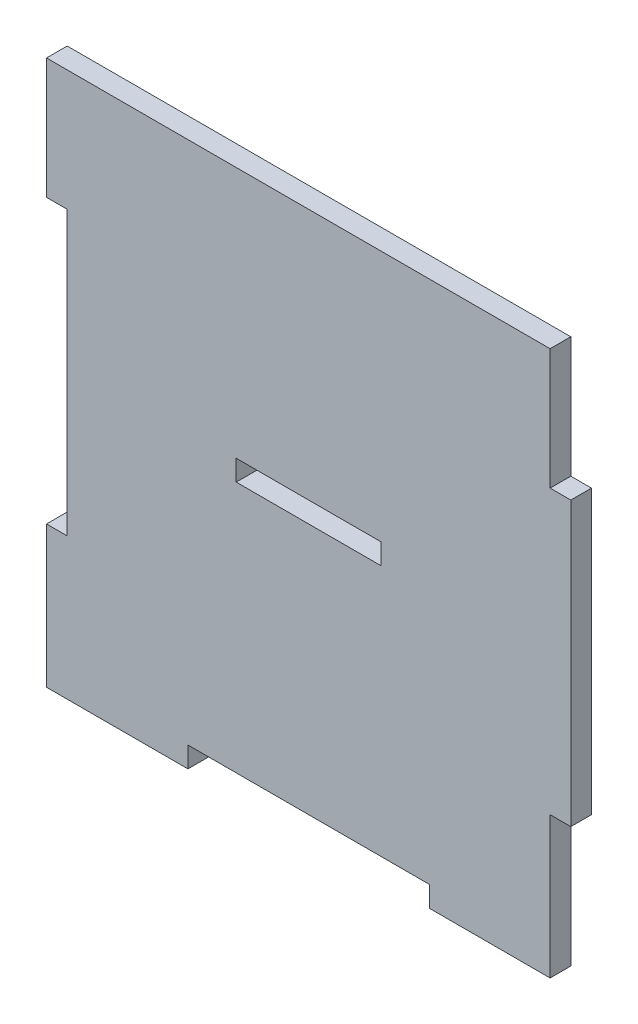
ISO-10303-21;
HEADER;
FILE_DESCRIPTION(('STEP AP214'),'2;1');
FILE_NAME('part.step','',(''),(''),'','','');
FILE_SCHEMA(('AUTOMOTIVE_DESIGN { 1 0 10303 214 1 1 1 1 }'));
ENDSEC;
DATA;
#1=APPLICATION_CONTEXT('core data for automotive mechanical design processes');
#2=APPLICATION_PROTOCOL_DEFINITION('international standard','automotive_design',2000,#1);
#3=PRODUCT_CONTEXT('',#1,'mechanical');
#4=PRODUCT('Part','Part','',(#3));
#5=PRODUCT_RELATED_PRODUCT_CATEGORY('part','',(#4));
#6=PRODUCT_DEFINITION_FORMATION('','',#4);
#7=PRODUCT_DEFINITION_CONTEXT('part definition',#1,'design');
#8=PRODUCT_DEFINITION('design','',#6,#7);
#9=PRODUCT_DEFINITION_SHAPE('','',#8);
#10=(LENGTH_UNIT() NAMED_UNIT(*) SI_UNIT(.MILLI.,.METRE.));
#11=(NAMED_UNIT(*) PLANE_ANGLE_UNIT() SI_UNIT($,.RADIAN.));
#12=(NAMED_UNIT(*) SI_UNIT($,.STERADIAN.) SOLID_ANGLE_UNIT());
#13=UNCERTAINTY_MEASURE_WITH_UNIT(LENGTH_MEASURE(1.E-05),#10,'distance_accuracy_value','');
#14=(GEOMETRIC_REPRESENTATION_CONTEXT(3) GLOBAL_UNCERTAINTY_ASSIGNED_CONTEXT((#13)) GLOBAL_UNIT_ASSIGNED_CONTEXT((#10,
#11,#12)) REPRESENTATION_CONTEXT('',''));
#15=CARTESIAN_POINT('',(0.,0.,0.));
#16=DIRECTION('',(0.,0.,1.));
#17=DIRECTION('',(1.,0.,0.));
#18=AXIS2_PLACEMENT_3D('',#15,#16,#17);
#19=CARTESIAN_POINT('',(35.,-20.5,3.));
#20=DIRECTION('',(0.,1.,0.));
#21=DIRECTION('',(-1.,0.,0.));
#22=AXIS2_PLACEMENT_3D('',#19,#20,#21);
#23=PLANE('',#22);
#24=DIRECTION('',(1.,0.,0.));
#25=VECTOR('',#24,1.);
#26=CARTESIAN_POINT('',(35.,-20.5,0.));
#27=LINE('',#26,#25);
#28=CARTESIAN_POINT('',(35.,-20.5,0.));
#29=VERTEX_POINT('',#28);
#30=CARTESIAN_POINT('',(38.,-20.5,0.));
#31=VERTEX_POINT('',#30);
#32=EDGE_CURVE('E218',#29,#31,#27,.T.);
#33=ORIENTED_EDGE('',*,*,#32,.T.);
#34=DIRECTION('',(0.,0.,-1.));
#35=VECTOR('',#34,1.);
#36=CARTESIAN_POINT('',(38.,-20.5,3.));
#37=LINE('',#36,#35);
#38=CARTESIAN_POINT('',(38.,-20.5,3.));
#39=VERTEX_POINT('',#38);
#40=EDGE_CURVE('E46',#39,#31,#37,.T.);
#41=ORIENTED_EDGE('',*,*,#40,.F.);
#42=DIRECTION('',(1.,0.,0.));
#43=VECTOR('',#42,1.);
#44=CARTESIAN_POINT('',(35.,-20.5,3.));
#45=LINE('',#44,#43);
#46=CARTESIAN_POINT('',(35.,-20.5,3.));
#47=VERTEX_POINT('',#46);
#48=EDGE_CURVE('E228',#47,#39,#45,.T.);
#49=ORIENTED_EDGE('',*,*,#48,.F.);
#50=DIRECTION('',(0.,0.,-1.));
#51=VECTOR('',#50,1.);
#52=CARTESIAN_POINT('',(35.,-20.5,3.));
#53=LINE('',#52,#51);
#54=EDGE_CURVE('E11',#47,#29,#53,.T.);
#55=ORIENTED_EDGE('',*,*,#54,.T.);
#56=EDGE_LOOP('',(#33,#41,#49,#55));
#57=FACE_BOUND('',#56,.T.);
#58=ADVANCED_FACE('F38',(#57),#23,.F.);
#59=CARTESIAN_POINT('',(38.,20.5,3.));
#60=DIRECTION('',(-1.,0.,0.));
#61=DIRECTION('',(0.,0.,1.));
#62=AXIS2_PLACEMENT_3D('',#59,#60,#61);
#63=PLANE('',#62);
#64=DIRECTION('',(0.,1.,0.));
#65=VECTOR('',#64,1.);
#66=CARTESIAN_POINT('',(38.,20.5,0.));
#67=LINE('',#66,#65);
#68=CARTESIAN_POINT('',(38.,20.5,0.));
#69=VERTEX_POINT('',#68);
#70=EDGE_CURVE('E278',#31,#69,#67,.T.);
#71=ORIENTED_EDGE('',*,*,#70,.T.);
#72=DIRECTION('',(0.,0.,-1.));
#73=VECTOR('',#72,1.);
#74=CARTESIAN_POINT('',(38.,20.5,3.));
#75=LINE('',#74,#73);
#76=CARTESIAN_POINT('',(38.,20.5,3.));
#77=VERTEX_POINT('',#76);
#78=EDGE_CURVE('E376',#77,#69,#75,.T.);
#79=ORIENTED_EDGE('',*,*,#78,.F.);
#80=DIRECTION('',(0.,1.,0.));
#81=VECTOR('',#80,1.);
#82=CARTESIAN_POINT('',(38.,20.5,3.));
#83=LINE('',#82,#81);
#84=EDGE_CURVE('E232',#39,#77,#83,.T.);
#85=ORIENTED_EDGE('',*,*,#84,.F.);
#86=ORIENTED_EDGE('',*,*,#40,.T.);
#87=EDGE_LOOP('',(#71,#79,#85,#86));
#88=FACE_BOUND('',#87,.T.);
#89=ADVANCED_FACE('F385',(#88),#63,.F.);
#90=CARTESIAN_POINT('',(35.,20.5,3.));
#91=DIRECTION('',(0.,-1.,0.));
#92=DIRECTION('',(1.,0.,0.));
#93=AXIS2_PLACEMENT_3D('',#90,#91,#92);
#94=PLANE('',#93);
#95=DIRECTION('',(-1.,0.,0.));
#96=VECTOR('',#95,1.);
#97=CARTESIAN_POINT('',(35.,20.5,0.));
#98=LINE('',#97,#96);
#99=CARTESIAN_POINT('',(35.,20.5,0.));
#100=VERTEX_POINT('',#99);
#101=EDGE_CURVE('E281',#69,#100,#98,.T.);
#102=ORIENTED_EDGE('',*,*,#101,.T.);
#103=DIRECTION('',(0.,0.,-1.));
#104=VECTOR('',#103,1.);
#105=CARTESIAN_POINT('',(35.,20.5,3.));
#106=LINE('',#105,#104);
#107=CARTESIAN_POINT('',(35.,20.5,3.));
#108=VERTEX_POINT('',#107);
#109=EDGE_CURVE('E372',#108,#100,#106,.T.);
#110=ORIENTED_EDGE('',*,*,#109,.F.);
#111=DIRECTION('',(-1.,0.,0.));
#112=VECTOR('',#111,1.);
#113=CARTESIAN_POINT('',(35.,20.5,3.));
#114=LINE('',#113,#112);
#115=EDGE_CURVE('E235',#77,#108,#114,.T.);
#116=ORIENTED_EDGE('',*,*,#115,.F.);
#117=ORIENTED_EDGE('',*,*,#78,.T.);
#118=EDGE_LOOP('',(#102,#110,#116,#117));
#119=FACE_BOUND('',#118,.T.);
#120=ADVANCED_FACE('F394',(#119),#94,.F.);
#121=CARTESIAN_POINT('',(35.,38.,3.));
#122=DIRECTION('',(-1.,0.,0.));
#123=DIRECTION('',(0.,-1.,0.));
#124=AXIS2_PLACEMENT_3D('',#121,#122,#123);
#125=PLANE('',#124);
#126=DIRECTION('',(0.,1.,0.));
#127=VECTOR('',#126,1.);
#128=CARTESIAN_POINT('',(35.,38.,0.));
#129=LINE('',#128,#127);
#130=CARTESIAN_POINT('',(35.,38.,0.));
#131=VERTEX_POINT('',#130);
#132=EDGE_CURVE('E284',#100,#131,#129,.T.);
#133=ORIENTED_EDGE('',*,*,#132,.T.);
#134=DIRECTION('',(0.,0.,-1.));
#135=VECTOR('',#134,1.);
#136=CARTESIAN_POINT('',(35.,38.,3.));
#137=LINE('',#136,#135);
#138=CARTESIAN_POINT('',(35.,38.,3.));
#139=VERTEX_POINT('',#138);
#140=EDGE_CURVE('E368',#139,#131,#137,.T.);
#141=ORIENTED_EDGE('',*,*,#140,.F.);
#142=DIRECTION('',(0.,1.,0.));
#143=VECTOR('',#142,1.);
#144=CARTESIAN_POINT('',(35.,38.,3.));
#145=LINE('',#144,#143);
#146=EDGE_CURVE('E238',#108,#139,#145,.T.);
#147=ORIENTED_EDGE('',*,*,#146,.F.);
#148=ORIENTED_EDGE('',*,*,#109,.T.);
#149=EDGE_LOOP('',(#133,#141,#147,#148));
#150=FACE_BOUND('',#149,.T.);
#151=ADVANCED_FACE('F398',(#150),#125,.F.);
#152=CARTESIAN_POINT('',(-38.,38.,3.));
#153=DIRECTION('',(0.,-1.,0.));
#154=DIRECTION('',(0.,0.,-1.));
#155=AXIS2_PLACEMENT_3D('',#152,#153,#154);
#156=PLANE('',#155);
#157=DIRECTION('',(-1.,0.,0.));
#158=VECTOR('',#157,1.);
#159=CARTESIAN_POINT('',(-38.,38.,0.));
#160=LINE('',#159,#158);
#161=CARTESIAN_POINT('',(-38.,38.,0.));
#162=VERTEX_POINT('',#161);
#163=EDGE_CURVE('E288',#131,#162,#160,.T.);
#164=ORIENTED_EDGE('',*,*,#163,.T.);
#165=DIRECTION('',(0.,0.,-1.));
#166=VECTOR('',#165,1.);
#167=CARTESIAN_POINT('',(-38.,38.,3.));
#168=LINE('',#167,#166);
#169=CARTESIAN_POINT('',(-38.,38.,3.));
#170=VERTEX_POINT('',#169);
#171=EDGE_CURVE('E364',#170,#162,#168,.T.);
#172=ORIENTED_EDGE('',*,*,#171,.F.);
#173=DIRECTION('',(-1.,0.,0.));
#174=VECTOR('',#173,1.);
#175=CARTESIAN_POINT('',(17.5,38.,3.));
#176=LINE('',#175,#174);
#177=EDGE_CURVE('E241',#139,#170,#176,.T.);
#178=ORIENTED_EDGE('',*,*,#177,.F.);
#179=ORIENTED_EDGE('',*,*,#140,.T.);
#180=EDGE_LOOP('',(#164,#172,#178,#179));
#181=FACE_BOUND('',#180,.T.);
#182=ADVANCED_FACE('F456',(#181),#156,.F.);
#183=CARTESIAN_POINT('',(-38.,20.5,3.));
#184=DIRECTION('',(1.,0.,0.));
#185=DIRECTION('',(0.,0.,-1.));
#186=AXIS2_PLACEMENT_3D('',#183,#184,#185);
#187=PLANE('',#186);
#188=DIRECTION('',(0.,-1.,0.));
#189=VECTOR('',#188,1.);
#190=CARTESIAN_POINT('',(-38.,20.5,0.));
#191=LINE('',#190,#189);
#192=CARTESIAN_POINT('',(-38.,20.5,0.));
#193=VERTEX_POINT('',#192);
#194=EDGE_CURVE('E291',#162,#193,#191,.T.);
#195=ORIENTED_EDGE('',*,*,#194,.T.);
#196=DIRECTION('',(0.,0.,-1.));
#197=VECTOR('',#196,1.);
#198=CARTESIAN_POINT('',(-38.,20.5,3.));
#199=LINE('',#198,#197);
#200=CARTESIAN_POINT('',(-38.,20.5,3.));
#201=VERTEX_POINT('',#200);
#202=EDGE_CURVE('E360',#201,#193,#199,.T.);
#203=ORIENTED_EDGE('',*,*,#202,.F.);
#204=DIRECTION('',(0.,-1.,0.));
#205=VECTOR('',#204,1.);
#206=CARTESIAN_POINT('',(-38.,20.5,3.));
#207=LINE('',#206,#205);
#208=EDGE_CURVE('E244',#170,#201,#207,.T.);
#209=ORIENTED_EDGE('',*,*,#208,.F.);
#210=ORIENTED_EDGE('',*,*,#171,.T.);
#211=EDGE_LOOP('',(#195,#203,#209,#210));
#212=FACE_BOUND('',#211,.T.);
#213=ADVANCED_FACE('F454',(#212),#187,.F.);
#214=CARTESIAN_POINT('',(-35.,20.5,3.));
#215=DIRECTION('',(0.,1.,0.));
#216=DIRECTION('',(0.,0.,1.));
#217=AXIS2_PLACEMENT_3D('',#214,#215,#216);
#218=PLANE('',#217);
#219=DIRECTION('',(1.,0.,0.));
#220=VECTOR('',#219,1.);
#221=CARTESIAN_POINT('',(-35.,20.5,0.));
#222=LINE('',#221,#220);
#223=CARTESIAN_POINT('',(-35.,20.5,0.));
#224=VERTEX_POINT('',#223);
#225=EDGE_CURVE('E294',#193,#224,#222,.T.);
#226=ORIENTED_EDGE('',*,*,#225,.T.);
#227=DIRECTION('',(0.,0.,-1.));
#228=VECTOR('',#227,1.);
#229=CARTESIAN_POINT('',(-35.,20.5,3.));
#230=LINE('',#229,#228);
#231=CARTESIAN_POINT('',(-35.,20.5,3.));
#232=VERTEX_POINT('',#231);
#233=EDGE_CURVE('E356',#232,#224,#230,.T.);
#234=ORIENTED_EDGE('',*,*,#233,.F.);
#235=DIRECTION('',(1.,0.,0.));
#236=VECTOR('',#235,1.);
#237=CARTESIAN_POINT('',(-35.,20.5,3.));
#238=LINE('',#237,#236);
#239=EDGE_CURVE('E247',#201,#232,#238,.T.);
#240=ORIENTED_EDGE('',*,*,#239,.F.);
#241=ORIENTED_EDGE('',*,*,#202,.T.);
#242=EDGE_LOOP('',(#226,#234,#240,#241));
#243=FACE_BOUND('',#242,.T.);
#244=ADVANCED_FACE('F449',(#243),#218,.F.);
#245=CARTESIAN_POINT('',(-35.,20.5,3.));
#246=DIRECTION('',(1.,0.,0.));
#247=DIRECTION('',(0.,0.,-1.));
#248=AXIS2_PLACEMENT_3D('',#245,#246,#247);
#249=PLANE('',#248);
#250=DIRECTION('',(0.,-1.,0.));
#251=VECTOR('',#250,1.);
#252=CARTESIAN_POINT('',(-35.,20.5,0.));
#253=LINE('',#252,#251);
#254=CARTESIAN_POINT('',(-35.,-20.5,0.));
#255=VERTEX_POINT('',#254);
#256=EDGE_CURVE('E297',#224,#255,#253,.T.);
#257=ORIENTED_EDGE('',*,*,#256,.T.);
#258=DIRECTION('',(0.,0.,-1.));
#259=VECTOR('',#258,1.);
#260=CARTESIAN_POINT('',(-35.,-20.5,3.));
#261=LINE('',#260,#259);
#262=CARTESIAN_POINT('',(-35.,-20.5,3.));
#263=VERTEX_POINT('',#262);
#264=EDGE_CURVE('E352',#263,#255,#261,.T.);
#265=ORIENTED_EDGE('',*,*,#264,.F.);
#266=DIRECTION('',(0.,-1.,0.));
#267=VECTOR('',#266,1.);
#268=CARTESIAN_POINT('',(-35.,20.5,3.));
#269=LINE('',#268,#267);
#270=EDGE_CURVE('E250',#232,#263,#269,.T.);
#271=ORIENTED_EDGE('',*,*,#270,.F.);
#272=ORIENTED_EDGE('',*,*,#233,.T.);
#273=EDGE_LOOP('',(#257,#265,#271,#272));
#274=FACE_BOUND('',#273,.T.);
#275=ADVANCED_FACE('F444',(#274),#249,.F.);
#276=CARTESIAN_POINT('',(-35.,-20.5,3.));
#277=DIRECTION('',(0.,-1.,0.));
#278=DIRECTION('',(0.,0.,-1.));
#279=AXIS2_PLACEMENT_3D('',#276,#277,#278);
#280=PLANE('',#279);
#281=DIRECTION('',(-1.,0.,0.));
#282=VECTOR('',#281,1.);
#283=CARTESIAN_POINT('',(-35.,-20.5,0.));
#284=LINE('',#283,#282);
#285=CARTESIAN_POINT('',(-38.,-20.5,0.));
#286=VERTEX_POINT('',#285);
#287=EDGE_CURVE('E300',#255,#286,#284,.T.);
#288=ORIENTED_EDGE('',*,*,#287,.T.);
#289=DIRECTION('',(0.,0.,-1.));
#290=VECTOR('',#289,1.);
#291=CARTESIAN_POINT('',(-38.,-20.5,3.));
#292=LINE('',#291,#290);
#293=CARTESIAN_POINT('',(-38.,-20.5,3.));
#294=VERTEX_POINT('',#293);
#295=EDGE_CURVE('E348',#294,#286,#292,.T.);
#296=ORIENTED_EDGE('',*,*,#295,.F.);
#297=DIRECTION('',(-1.,0.,0.));
#298=VECTOR('',#297,1.);
#299=CARTESIAN_POINT('',(-35.,-20.5,3.));
#300=LINE('',#299,#298);
#301=EDGE_CURVE('E253',#263,#294,#300,.T.);
#302=ORIENTED_EDGE('',*,*,#301,.F.);
#303=ORIENTED_EDGE('',*,*,#264,.T.);
#304=EDGE_LOOP('',(#288,#296,#302,#303));
#305=FACE_BOUND('',#304,.T.);
#306=ADVANCED_FACE('F439',(#305),#280,.F.);
#307=CARTESIAN_POINT('',(-38.,-38.,3.));
#308=DIRECTION('',(1.,0.,0.));
#309=DIRECTION('',(0.,0.,-1.));
#310=AXIS2_PLACEMENT_3D('',#307,#308,#309);
#311=PLANE('',#310);
#312=DIRECTION('',(0.,-1.,0.));
#313=VECTOR('',#312,1.);
#314=CARTESIAN_POINT('',(-38.,-38.,0.));
#315=LINE('',#314,#313);
#316=CARTESIAN_POINT('',(-38.,-41.,0.));
#317=VERTEX_POINT('',#316);
#318=EDGE_CURVE('E304',#286,#317,#315,.T.);
#319=ORIENTED_EDGE('',*,*,#318,.T.);
#320=DIRECTION('',(0.,0.,-1.));
#321=VECTOR('',#320,1.);
#322=CARTESIAN_POINT('',(-38.,-41.,3.));
#323=LINE('',#322,#321);
#324=CARTESIAN_POINT('',(-38.,-41.,3.));
#325=VERTEX_POINT('',#324);
#326=EDGE_CURVE('E344',#325,#317,#323,.T.);
#327=ORIENTED_EDGE('',*,*,#326,.F.);
#328=DIRECTION('',(0.,-1.,0.));
#329=VECTOR('',#328,1.);
#330=CARTESIAN_POINT('',(-38.,-20.5,3.));
#331=LINE('',#330,#329);
#332=EDGE_CURVE('E256',#294,#325,#331,.T.);
#333=ORIENTED_EDGE('',*,*,#332,.F.);
#334=ORIENTED_EDGE('',*,*,#295,.T.);
#335=EDGE_LOOP('',(#319,#327,#333,#334));
#336=FACE_BOUND('',#335,.T.);
#337=ADVANCED_FACE('F434',(#336),#311,.F.);
#338=CARTESIAN_POINT('',(-35.,-41.,3.));
#339=DIRECTION('',(0.,1.,0.));
#340=DIRECTION('',(0.,0.,1.));
#341=AXIS2_PLACEMENT_3D('',#338,#339,#340);
#342=PLANE('',#341);
#343=DIRECTION('',(1.,0.,0.));
#344=VECTOR('',#343,1.);
#345=CARTESIAN_POINT('',(-35.,-41.,0.));
#346=LINE('',#345,#344);
#347=CARTESIAN_POINT('',(-17.5,-41.,0.));
#348=VERTEX_POINT('',#347);
#349=EDGE_CURVE('E308',#317,#348,#346,.T.);
#350=ORIENTED_EDGE('',*,*,#349,.T.);
#351=DIRECTION('',(0.,0.,-1.));
#352=VECTOR('',#351,1.);
#353=CARTESIAN_POINT('',(-17.5,-41.,3.));
#354=LINE('',#353,#352);
#355=CARTESIAN_POINT('',(-17.5,-41.,3.));
#356=VERTEX_POINT('',#355);
#357=EDGE_CURVE('E340',#356,#348,#354,.T.);
#358=ORIENTED_EDGE('',*,*,#357,.F.);
#359=DIRECTION('',(1.,0.,0.));
#360=VECTOR('',#359,1.);
#361=CARTESIAN_POINT('',(-38.,-41.,3.));
#362=LINE('',#361,#360);
#363=EDGE_CURVE('E259',#325,#356,#362,.T.);
#364=ORIENTED_EDGE('',*,*,#363,.F.);
#365=ORIENTED_EDGE('',*,*,#326,.T.);
#366=EDGE_LOOP('',(#350,#358,#364,#365));
#367=FACE_BOUND('',#366,.T.);
#368=ADVANCED_FACE('F430',(#367),#342,.F.);
#369=CARTESIAN_POINT('',(-17.5,-38.,3.));
#370=DIRECTION('',(-1.,0.,0.));
#371=DIRECTION('',(0.,0.,1.));
#372=AXIS2_PLACEMENT_3D('',#369,#370,#371);
#373=PLANE('',#372);
#374=DIRECTION('',(0.,1.,0.));
#375=VECTOR('',#374,1.);
#376=CARTESIAN_POINT('',(-17.5,-38.,0.));
#377=LINE('',#376,#375);
#378=CARTESIAN_POINT('',(-17.5,-38.,0.));
#379=VERTEX_POINT('',#378);
#380=EDGE_CURVE('E311',#348,#379,#377,.T.);
#381=ORIENTED_EDGE('',*,*,#380,.T.);
#382=DIRECTION('',(0.,0.,-1.));
#383=VECTOR('',#382,1.);
#384=CARTESIAN_POINT('',(-17.5,-38.,3.));
#385=LINE('',#384,#383);
#386=CARTESIAN_POINT('',(-17.5,-38.,3.));
#387=VERTEX_POINT('',#386);
#388=EDGE_CURVE('E336',#387,#379,#385,.T.);
#389=ORIENTED_EDGE('',*,*,#388,.F.);
#390=DIRECTION('',(0.,1.,0.));
#391=VECTOR('',#390,1.);
#392=CARTESIAN_POINT('',(-17.5,-38.,3.));
#393=LINE('',#392,#391);
#394=EDGE_CURVE('E262',#356,#387,#393,.T.);
#395=ORIENTED_EDGE('',*,*,#394,.F.);
#396=ORIENTED_EDGE('',*,*,#357,.T.);
#397=EDGE_LOOP('',(#381,#389,#395,#396));
#398=FACE_BOUND('',#397,.T.);
#399=ADVANCED_FACE('F425',(#398),#373,.F.);
#400=CARTESIAN_POINT('',(-17.5,-38.,3.));
#401=DIRECTION('',(0.,1.,0.));
#402=DIRECTION('',(-1.,0.,0.));
#403=AXIS2_PLACEMENT_3D('',#400,#401,#402);
#404=PLANE('',#403);
#405=DIRECTION('',(1.,0.,0.));
#406=VECTOR('',#405,1.);
#407=CARTESIAN_POINT('',(-17.5,-38.,0.));
#408=LINE('',#407,#406);
#409=CARTESIAN_POINT('',(17.5,-38.,0.));
#410=VERTEX_POINT('',#409);
#411=EDGE_CURVE('E314',#379,#410,#408,.T.);
#412=ORIENTED_EDGE('',*,*,#411,.T.);
#413=DIRECTION('',(0.,0.,-1.));
#414=VECTOR('',#413,1.);
#415=CARTESIAN_POINT('',(17.5,-38.,3.));
#416=LINE('',#415,#414);
#417=CARTESIAN_POINT('',(17.5,-38.,3.));
#418=VERTEX_POINT('',#417);
#419=EDGE_CURVE('E332',#418,#410,#416,.T.);
#420=ORIENTED_EDGE('',*,*,#419,.F.);
#421=DIRECTION('',(1.,0.,0.));
#422=VECTOR('',#421,1.);
#423=CARTESIAN_POINT('',(-17.5,-38.,3.));
#424=LINE('',#423,#422);
#425=EDGE_CURVE('E265',#387,#418,#424,.T.);
#426=ORIENTED_EDGE('',*,*,#425,.F.);
#427=ORIENTED_EDGE('',*,*,#388,.T.);
#428=EDGE_LOOP('',(#412,#420,#426,#427));
#429=FACE_BOUND('',#428,.T.);
#430=ADVANCED_FACE('F421',(#429),#404,.F.);
#431=CARTESIAN_POINT('',(17.5,-41.,3.));
#432=DIRECTION('',(1.,0.,0.));
#433=DIRECTION('',(0.,1.,0.));
#434=AXIS2_PLACEMENT_3D('',#431,#432,#433);
#435=PLANE('',#434);
#436=DIRECTION('',(0.,-1.,0.));
#437=VECTOR('',#436,1.);
#438=CARTESIAN_POINT('',(17.5,-41.,0.));
#439=LINE('',#438,#437);
#440=CARTESIAN_POINT('',(17.5,-41.,0.));
#441=VERTEX_POINT('',#440);
#442=EDGE_CURVE('E317',#410,#441,#439,.T.);
#443=ORIENTED_EDGE('',*,*,#442,.T.);
#444=DIRECTION('',(0.,0.,-1.));
#445=VECTOR('',#444,1.);
#446=CARTESIAN_POINT('',(17.5,-41.,3.));
#447=LINE('',#446,#445);
#448=CARTESIAN_POINT('',(17.5,-41.,3.));
#449=VERTEX_POINT('',#448);
#450=EDGE_CURVE('E328',#449,#441,#447,.T.);
#451=ORIENTED_EDGE('',*,*,#450,.F.);
#452=DIRECTION('',(0.,-1.,0.));
#453=VECTOR('',#452,1.);
#454=CARTESIAN_POINT('',(17.5,-41.,3.));
#455=LINE('',#454,#453);
#456=EDGE_CURVE('E268',#418,#449,#455,.T.);
#457=ORIENTED_EDGE('',*,*,#456,.F.);
#458=ORIENTED_EDGE('',*,*,#419,.T.);
#459=EDGE_LOOP('',(#443,#451,#457,#458));
#460=FACE_BOUND('',#459,.T.);
#461=ADVANCED_FACE('F417',(#460),#435,.F.);
#462=CARTESIAN_POINT('',(35.,-41.,3.));
#463=DIRECTION('',(0.,1.,0.));
#464=DIRECTION('',(-1.,0.,0.));
#465=AXIS2_PLACEMENT_3D('',#462,#463,#464);
#466=PLANE('',#465);
#467=DIRECTION('',(1.,0.,0.));
#468=VECTOR('',#467,1.);
#469=CARTESIAN_POINT('',(35.,-41.,0.));
#470=LINE('',#469,#468);
#471=CARTESIAN_POINT('',(35.,-41.,0.));
#472=VERTEX_POINT('',#471);
#473=EDGE_CURVE('E320',#441,#472,#470,.T.);
#474=ORIENTED_EDGE('',*,*,#473,.T.);
#475=DIRECTION('',(0.,0.,-1.));
#476=VECTOR('',#475,1.);
#477=CARTESIAN_POINT('',(35.,-41.,3.));
#478=LINE('',#477,#476);
#479=CARTESIAN_POINT('',(35.,-41.,3.));
#480=VERTEX_POINT('',#479);
#481=EDGE_CURVE('E275',#480,#472,#478,.T.);
#482=ORIENTED_EDGE('',*,*,#481,.F.);
#483=DIRECTION('',(1.,0.,0.));
#484=VECTOR('',#483,1.);
#485=CARTESIAN_POINT('',(35.,-41.,3.));
#486=LINE('',#485,#484);
#487=EDGE_CURVE('E271',#449,#480,#486,.T.);
#488=ORIENTED_EDGE('',*,*,#487,.F.);
#489=ORIENTED_EDGE('',*,*,#450,.T.);
#490=EDGE_LOOP('',(#474,#482,#488,#489));
#491=FACE_BOUND('',#490,.T.);
#492=ADVANCED_FACE('F412',(#491),#466,.F.);
#493=CARTESIAN_POINT('',(35.,-38.,3.));
#494=DIRECTION('',(-1.,0.,0.));
#495=DIRECTION('',(0.,-1.,0.));
#496=AXIS2_PLACEMENT_3D('',#493,#494,#495);
#497=PLANE('',#496);
#498=DIRECTION('',(0.,1.,0.));
#499=VECTOR('',#498,1.);
#500=CARTESIAN_POINT('',(35.,-38.,0.));
#501=LINE('',#500,#499);
#502=EDGE_CURVE('E229',#472,#29,#501,.T.);
#503=ORIENTED_EDGE('',*,*,#502,.T.);
#504=ORIENTED_EDGE('',*,*,#54,.F.);
#505=DIRECTION('',(0.,1.,0.));
#506=VECTOR('',#505,1.);
#507=CARTESIAN_POINT('',(35.,-20.5,3.));
#508=LINE('',#507,#506);
#509=EDGE_CURVE('E224',#480,#47,#508,.T.);
#510=ORIENTED_EDGE('',*,*,#509,.F.);
#511=ORIENTED_EDGE('',*,*,#481,.T.);
#512=EDGE_LOOP('',(#503,#504,#510,#511));
#513=FACE_BOUND('',#512,.T.);
#514=ADVANCED_FACE('F406',(#513),#497,.F.);
#515=CARTESIAN_POINT('',(0.,0.,3.));
#516=DIRECTION('',(0.,0.,-1.));
#517=DIRECTION('',(-1.,0.,0.));
#518=AXIS2_PLACEMENT_3D('',#515,#516,#517);
#519=PLANE('',#518);
#520=DIRECTION('',(-1.,0.,0.));
#521=VECTOR('',#520,1.);
#522=CARTESIAN_POINT('',(-10.5,1.5,3.));
#523=LINE('',#522,#521);
#524=CARTESIAN_POINT('',(10.5,1.5,3.));
#525=VERTEX_POINT('',#524);
#526=CARTESIAN_POINT('',(-10.5,1.5,3.));
#527=VERTEX_POINT('',#526);
#528=EDGE_CURVE('E209',#525,#527,#523,.T.);
#529=ORIENTED_EDGE('',*,*,#528,.F.);
#530=DIRECTION('',(0.,1.,0.));
#531=VECTOR('',#530,1.);
#532=CARTESIAN_POINT('',(10.5,-1.5,3.));
#533=LINE('',#532,#531);
#534=CARTESIAN_POINT('',(10.5,-1.5,3.));
#535=VERTEX_POINT('',#534);
#536=EDGE_CURVE('E53',#535,#525,#533,.T.);
#537=ORIENTED_EDGE('',*,*,#536,.F.);
#538=DIRECTION('',(1.,0.,0.));
#539=VECTOR('',#538,1.);
#540=CARTESIAN_POINT('',(-10.5,-1.5,3.));
#541=LINE('',#540,#539);
#542=CARTESIAN_POINT('',(-10.5,-1.5,3.));
#543=VERTEX_POINT('',#542);
#544=EDGE_CURVE('E196',#543,#535,#541,.T.);
#545=ORIENTED_EDGE('',*,*,#544,.F.);
#546=DIRECTION('',(0.,-1.,0.));
#547=VECTOR('',#546,1.);
#548=CARTESIAN_POINT('',(-10.5,-1.5,3.));
#549=LINE('',#548,#547);
#550=EDGE_CURVE('E200',#527,#543,#549,.T.);
#551=ORIENTED_EDGE('',*,*,#550,.F.);
#552=EDGE_LOOP('',(#529,#537,#545,#551));
#553=FACE_BOUND('',#552,.T.);
#554=ORIENTED_EDGE('',*,*,#509,.T.);
#555=ORIENTED_EDGE('',*,*,#48,.T.);
#556=ORIENTED_EDGE('',*,*,#84,.T.);
#557=ORIENTED_EDGE('',*,*,#115,.T.);
#558=ORIENTED_EDGE('',*,*,#146,.T.);
#559=ORIENTED_EDGE('',*,*,#177,.T.);
#560=ORIENTED_EDGE('',*,*,#208,.T.);
#561=ORIENTED_EDGE('',*,*,#239,.T.);
#562=ORIENTED_EDGE('',*,*,#270,.T.);
#563=ORIENTED_EDGE('',*,*,#301,.T.);
#564=ORIENTED_EDGE('',*,*,#332,.T.);
#565=ORIENTED_EDGE('',*,*,#363,.T.);
#566=ORIENTED_EDGE('',*,*,#394,.T.);
#567=ORIENTED_EDGE('',*,*,#425,.T.);
#568=ORIENTED_EDGE('',*,*,#456,.T.);
#569=ORIENTED_EDGE('',*,*,#487,.T.);
#570=EDGE_LOOP('',(#554,#555,#556,#557,#558,#559,#560,#561,#562,#563,#564,#565,#566,#567,#568,#569));
#571=FACE_BOUND('',#570,.T.);
#572=ADVANCED_FACE('F402',(#553,#571),#519,.F.);
#573=CARTESIAN_POINT('',(0.,0.,0.));
#574=DIRECTION('',(0.,0.,-1.));
#575=DIRECTION('',(-1.,0.,0.));
#576=AXIS2_PLACEMENT_3D('',#573,#574,#575);
#577=PLANE('',#576);
#578=DIRECTION('',(0.,1.,0.));
#579=VECTOR('',#578,1.);
#580=CARTESIAN_POINT('',(10.5,-1.5,0.));
#581=LINE('',#580,#579);
#582=CARTESIAN_POINT('',(10.5,-1.5,0.));
#583=VERTEX_POINT('',#582);
#584=CARTESIAN_POINT('',(10.5,1.5,0.));
#585=VERTEX_POINT('',#584);
#586=EDGE_CURVE('E177',#583,#585,#581,.T.);
#587=ORIENTED_EDGE('',*,*,#586,.T.);
#588=DIRECTION('',(-1.,0.,0.));
#589=VECTOR('',#588,1.);
#590=CARTESIAN_POINT('',(-10.5,1.5,0.));
#591=LINE('',#590,#589);
#592=CARTESIAN_POINT('',(-10.5,1.5,0.));
#593=VERTEX_POINT('',#592);
#594=EDGE_CURVE('E187',#585,#593,#591,.T.);
#595=ORIENTED_EDGE('',*,*,#594,.T.);
#596=DIRECTION('',(0.,-1.,0.));
#597=VECTOR('',#596,1.);
#598=CARTESIAN_POINT('',(-10.5,-1.5,0.));
#599=LINE('',#598,#597);
#600=CARTESIAN_POINT('',(-10.5,-1.5,0.));
#601=VERTEX_POINT('',#600);
#602=EDGE_CURVE('E61',#593,#601,#599,.T.);
#603=ORIENTED_EDGE('',*,*,#602,.T.);
#604=DIRECTION('',(1.,0.,0.));
#605=VECTOR('',#604,1.);
#606=CARTESIAN_POINT('',(-10.5,-1.5,0.));
#607=LINE('',#606,#605);
#608=EDGE_CURVE('E184',#601,#583,#607,.T.);
#609=ORIENTED_EDGE('',*,*,#608,.T.);
#610=EDGE_LOOP('',(#587,#595,#603,#609));
#611=FACE_BOUND('',#610,.T.);
#612=ORIENTED_EDGE('',*,*,#32,.F.);
#613=ORIENTED_EDGE('',*,*,#502,.F.);
#614=ORIENTED_EDGE('',*,*,#473,.F.);
#615=ORIENTED_EDGE('',*,*,#442,.F.);
#616=ORIENTED_EDGE('',*,*,#411,.F.);
#617=ORIENTED_EDGE('',*,*,#380,.F.);
#618=ORIENTED_EDGE('',*,*,#349,.F.);
#619=ORIENTED_EDGE('',*,*,#318,.F.);
#620=ORIENTED_EDGE('',*,*,#287,.F.);
#621=ORIENTED_EDGE('',*,*,#256,.F.);
#622=ORIENTED_EDGE('',*,*,#225,.F.);
#623=ORIENTED_EDGE('',*,*,#194,.F.);
#624=ORIENTED_EDGE('',*,*,#163,.F.);
#625=ORIENTED_EDGE('',*,*,#132,.F.);
#626=ORIENTED_EDGE('',*,*,#101,.F.);
#627=ORIENTED_EDGE('',*,*,#70,.F.);
#628=EDGE_LOOP('',(#612,#613,#614,#615,#616,#617,#618,#619,#620,#621,#622,#623,#624,#625,#626,#627));
#629=FACE_BOUND('',#628,.T.);
#630=ADVANCED_FACE('F192',(#611,#629),#577,.T.);
#631=CARTESIAN_POINT('',(10.5,-1.5,0.));
#632=DIRECTION('',(1.,0.,0.));
#633=DIRECTION('',(0.,0.,-1.));
#634=AXIS2_PLACEMENT_3D('',#631,#632,#633);
#635=PLANE('',#634);
#636=ORIENTED_EDGE('',*,*,#536,.T.);
#637=DIRECTION('',(0.,0.,1.));
#638=VECTOR('',#637,1.);
#639=CARTESIAN_POINT('',(10.5,1.5,0.));
#640=LINE('',#639,#638);
#641=EDGE_CURVE('E173',#585,#525,#640,.T.);
#642=ORIENTED_EDGE('',*,*,#641,.F.);
#643=ORIENTED_EDGE('',*,*,#586,.F.);
#644=DIRECTION('',(0.,0.,1.));
#645=VECTOR('',#644,1.);
#646=CARTESIAN_POINT('',(10.5,-1.5,0.));
#647=LINE('',#646,#645);
#648=EDGE_CURVE('E215',#583,#535,#647,.T.);
#649=ORIENTED_EDGE('',*,*,#648,.T.);
#650=EDGE_LOOP('',(#636,#642,#643,#649));
#651=FACE_BOUND('',#650,.T.);
#652=ADVANCED_FACE('F175',(#651),#635,.F.);
#653=CARTESIAN_POINT('',(-10.5,-1.5,0.));
#654=DIRECTION('',(0.,-1.,0.));
#655=DIRECTION('',(0.,0.,-1.));
#656=AXIS2_PLACEMENT_3D('',#653,#654,#655);
#657=PLANE('',#656);
#658=ORIENTED_EDGE('',*,*,#544,.T.);
#659=ORIENTED_EDGE('',*,*,#648,.F.);
#660=ORIENTED_EDGE('',*,*,#608,.F.);
#661=DIRECTION('',(0.,0.,1.));
#662=VECTOR('',#661,1.);
#663=CARTESIAN_POINT('',(-10.5,-1.5,0.));
#664=LINE('',#663,#662);
#665=EDGE_CURVE('E219',#601,#543,#664,.T.);
#666=ORIENTED_EDGE('',*,*,#665,.T.);
#667=EDGE_LOOP('',(#658,#659,#660,#666));
#668=FACE_BOUND('',#667,.T.);
#669=ADVANCED_FACE('F600',(#668),#657,.F.);
#670=CARTESIAN_POINT('',(-10.5,-1.5,0.));
#671=DIRECTION('',(-1.,0.,0.));
#672=DIRECTION('',(0.,0.,1.));
#673=AXIS2_PLACEMENT_3D('',#670,#671,#672);
#674=PLANE('',#673);
#675=ORIENTED_EDGE('',*,*,#550,.T.);
#676=ORIENTED_EDGE('',*,*,#665,.F.);
#677=ORIENTED_EDGE('',*,*,#602,.F.);
#678=DIRECTION('',(0.,0.,1.));
#679=VECTOR('',#678,1.);
#680=CARTESIAN_POINT('',(-10.5,1.5,0.));
#681=LINE('',#680,#679);
#682=EDGE_CURVE('E183',#593,#527,#681,.T.);
#683=ORIENTED_EDGE('',*,*,#682,.T.);
#684=EDGE_LOOP('',(#675,#676,#677,#683));
#685=FACE_BOUND('',#684,.T.);
#686=ADVANCED_FACE('F609',(#685),#674,.F.);
#687=CARTESIAN_POINT('',(-10.5,1.5,0.));
#688=DIRECTION('',(0.,1.,0.));
#689=DIRECTION('',(0.,0.,1.));
#690=AXIS2_PLACEMENT_3D('',#687,#688,#689);
#691=PLANE('',#690);
#692=ORIENTED_EDGE('',*,*,#528,.T.);
#693=ORIENTED_EDGE('',*,*,#682,.F.);
#694=ORIENTED_EDGE('',*,*,#594,.F.);
#695=ORIENTED_EDGE('',*,*,#641,.T.);
#696=EDGE_LOOP('',(#692,#693,#694,#695));
#697=FACE_BOUND('',#696,.T.);
#698=ADVANCED_FACE('F188',(#697),#691,.F.);
#699=CLOSED_SHELL('',(#58,#89,#120,#151,#182,#213,#244,#275,#306,#337,#368,#399,#430,#461,#492,
#514,#572,#630,#652,#669,#686,#698));
#700=MANIFOLD_SOLID_BREP('B2',#699);
#701=ADVANCED_BREP_SHAPE_REPRESENTATION('',(#18,#700),#14);
#702=SHAPE_DEFINITION_REPRESENTATION(#9,#701);
ENDSEC;
END-ISO-10303-21;
